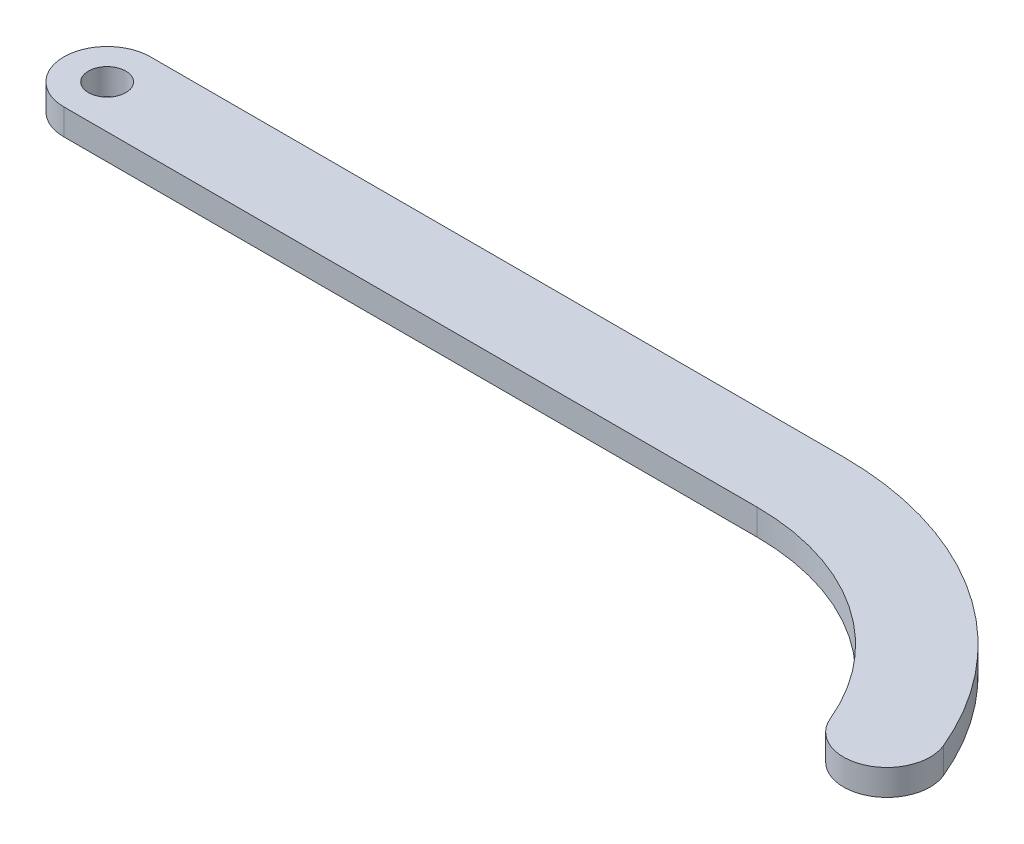
ISO-10303-21;
HEADER;
FILE_DESCRIPTION(('STEP AP214'),'2;1');
FILE_NAME('part.step','',(''),(''),'','','');
FILE_SCHEMA(('AUTOMOTIVE_DESIGN { 1 0 10303 214 1 1 1 1 }'));
ENDSEC;
DATA;
#1=APPLICATION_CONTEXT('core data for automotive mechanical design processes');
#2=APPLICATION_PROTOCOL_DEFINITION('international standard','automotive_design',2000,#1);
#3=PRODUCT_CONTEXT('',#1,'mechanical');
#4=PRODUCT('Part','Part','',(#3));
#5=PRODUCT_RELATED_PRODUCT_CATEGORY('part','',(#4));
#6=PRODUCT_DEFINITION_FORMATION('','',#4);
#7=PRODUCT_DEFINITION_CONTEXT('part definition',#1,'design');
#8=PRODUCT_DEFINITION('design','',#6,#7);
#9=PRODUCT_DEFINITION_SHAPE('','',#8);
#10=(LENGTH_UNIT() NAMED_UNIT(*) SI_UNIT(.MILLI.,.METRE.));
#11=(NAMED_UNIT(*) PLANE_ANGLE_UNIT() SI_UNIT($,.RADIAN.));
#12=(NAMED_UNIT(*) SI_UNIT($,.STERADIAN.) SOLID_ANGLE_UNIT());
#13=UNCERTAINTY_MEASURE_WITH_UNIT(LENGTH_MEASURE(1.E-05),#10,'distance_accuracy_value','');
#14=(GEOMETRIC_REPRESENTATION_CONTEXT(3) GLOBAL_UNCERTAINTY_ASSIGNED_CONTEXT((#13)) GLOBAL_UNIT_ASSIGNED_CONTEXT((#10,
#11,#12)) REPRESENTATION_CONTEXT('',''));
#15=CARTESIAN_POINT('',(0.,0.,0.));
#16=DIRECTION('',(0.,0.,1.));
#17=DIRECTION('',(1.,0.,0.));
#18=AXIS2_PLACEMENT_3D('',#15,#16,#17);
#19=CARTESIAN_POINT('',(0.,3.,0.));
#20=DIRECTION('',(0.,-1.,0.));
#21=DIRECTION('',(0.,0.,-1.));
#22=AXIS2_PLACEMENT_3D('',#19,#20,#21);
#23=CYLINDRICAL_SURFACE('',#22,5.);
#24=CARTESIAN_POINT('',(0.,0.,0.));
#25=DIRECTION('',(0.,1.,0.));
#26=DIRECTION('',(0.,0.,-1.));
#27=AXIS2_PLACEMENT_3D('',#24,#25,#26);
#28=CIRCLE('',#27,5.);
#29=CARTESIAN_POINT('',(0.,0.,-5.));
#30=VERTEX_POINT('',#29);
#31=CARTESIAN_POINT('',(0.,0.,5.));
#32=VERTEX_POINT('',#31);
#33=EDGE_CURVE('E117',#30,#32,#28,.T.);
#34=ORIENTED_EDGE('',*,*,#33,.T.);
#35=DIRECTION('',(0.,-1.,0.));
#36=VECTOR('',#35,1.);
#37=CARTESIAN_POINT('',(0.,3.,5.));
#38=LINE('',#37,#36);
#39=CARTESIAN_POINT('',(0.,3.,5.));
#40=VERTEX_POINT('',#39);
#41=EDGE_CURVE('E11',#40,#32,#38,.T.);
#42=ORIENTED_EDGE('',*,*,#41,.F.);
#43=CARTESIAN_POINT('',(0.,3.,0.));
#44=DIRECTION('',(0.,1.,0.));
#45=DIRECTION('',(0.,0.,-1.));
#46=AXIS2_PLACEMENT_3D('',#43,#44,#45);
#47=CIRCLE('',#46,5.);
#48=CARTESIAN_POINT('',(0.,3.,-5.));
#49=VERTEX_POINT('',#48);
#50=EDGE_CURVE('E128',#49,#40,#47,.T.);
#51=ORIENTED_EDGE('',*,*,#50,.F.);
#52=DIRECTION('',(0.,-1.,0.));
#53=VECTOR('',#52,1.);
#54=CARTESIAN_POINT('',(0.,3.,-5.));
#55=LINE('',#54,#53);
#56=EDGE_CURVE('E113',#49,#30,#55,.T.);
#57=ORIENTED_EDGE('',*,*,#56,.T.);
#58=EDGE_LOOP('',(#34,#42,#51,#57));
#59=FACE_BOUND('',#58,.T.);
#60=ADVANCED_FACE('F33',(#59),#23,.T.);
#61=CARTESIAN_POINT('',(80.0000000000004,3.,4.99999999999999));
#62=DIRECTION('',(0.,0.,-1.));
#63=DIRECTION('',(-1.,0.,0.));
#64=AXIS2_PLACEMENT_3D('',#61,#62,#63);
#65=PLANE('',#64);
#66=DIRECTION('',(1.,0.,0.));
#67=VECTOR('',#66,1.);
#68=CARTESIAN_POINT('',(80.0000000000004,0.,4.99999999999999));
#69=LINE('',#68,#67);
#70=CARTESIAN_POINT('',(80.0000000000004,0.,4.99999999999988));
#71=VERTEX_POINT('',#70);
#72=EDGE_CURVE('E120',#32,#71,#69,.T.);
#73=ORIENTED_EDGE('',*,*,#72,.T.);
#74=DIRECTION('',(0.,-1.,0.));
#75=VECTOR('',#74,1.);
#76=CARTESIAN_POINT('',(80.0000000000004,3.,4.99999999999988));
#77=LINE('',#76,#75);
#78=CARTESIAN_POINT('',(80.0000000000004,3.,4.99999999999988));
#79=VERTEX_POINT('',#78);
#80=EDGE_CURVE('E41',#79,#71,#77,.T.);
#81=ORIENTED_EDGE('',*,*,#80,.F.);
#82=DIRECTION('',(1.,0.,0.));
#83=VECTOR('',#82,1.);
#84=CARTESIAN_POINT('',(80.0000000000004,3.,4.99999999999999));
#85=LINE('',#84,#83);
#86=EDGE_CURVE('E86',#40,#79,#85,.T.);
#87=ORIENTED_EDGE('',*,*,#86,.F.);
#88=ORIENTED_EDGE('',*,*,#41,.T.);
#89=EDGE_LOOP('',(#73,#81,#87,#88));
#90=FACE_BOUND('',#89,.T.);
#91=ADVANCED_FACE('F153',(#90),#65,.F.);
#92=CARTESIAN_POINT('',(80.0000000000004,3.,32.4999999999991));
#93=DIRECTION('',(0.,-1.,0.));
#94=DIRECTION('',(0.,0.,-1.));
#95=AXIS2_PLACEMENT_3D('',#92,#93,#94);
#96=CYLINDRICAL_SURFACE('',#95,27.4999999999992);
#97=CARTESIAN_POINT('',(80.0000000000004,0.,32.4999999999991));
#98=DIRECTION('',(0.,-1.,0.));
#99=DIRECTION('',(0.,0.,1.));
#100=AXIS2_PLACEMENT_3D('',#97,#98,#99);
#101=CIRCLE('',#100,27.4999999999992);
#102=CARTESIAN_POINT('',(105.384615384615,0.,21.9230769230769));
#103=VERTEX_POINT('',#102);
#104=EDGE_CURVE('E123',#71,#103,#101,.T.);
#105=ORIENTED_EDGE('',*,*,#104,.T.);
#106=DIRECTION('',(0.,-1.,0.));
#107=VECTOR('',#106,1.);
#108=CARTESIAN_POINT('',(105.384615384615,3.,21.9230769230769));
#109=LINE('',#108,#107);
#110=CARTESIAN_POINT('',(105.384615384615,3.,21.9230769230769));
#111=VERTEX_POINT('',#110);
#112=EDGE_CURVE('E108',#111,#103,#109,.T.);
#113=ORIENTED_EDGE('',*,*,#112,.F.);
#114=CARTESIAN_POINT('',(80.0000000000004,3.,32.4999999999991));
#115=DIRECTION('',(0.,-1.,0.));
#116=DIRECTION('',(0.,0.,1.));
#117=AXIS2_PLACEMENT_3D('',#114,#115,#116);
#118=CIRCLE('',#117,27.4999999999992);
#119=EDGE_CURVE('E99',#79,#111,#118,.T.);
#120=ORIENTED_EDGE('',*,*,#119,.F.);
#121=ORIENTED_EDGE('',*,*,#80,.T.);
#122=EDGE_LOOP('',(#105,#113,#120,#121));
#123=FACE_BOUND('',#122,.T.);
#124=ADVANCED_FACE('F134',(#123),#96,.F.);
#125=CARTESIAN_POINT('',(110.,3.,20.));
#126=DIRECTION('',(0.,-1.,0.));
#127=DIRECTION('',(0.,0.,-1.));
#128=AXIS2_PLACEMENT_3D('',#125,#126,#127);
#129=CYLINDRICAL_SURFACE('',#128,5.);
#130=CARTESIAN_POINT('',(110.,0.,20.));
#131=DIRECTION('',(0.,1.,0.));
#132=DIRECTION('',(0.,0.,-1.));
#133=AXIS2_PLACEMENT_3D('',#130,#131,#132);
#134=CIRCLE('',#133,5.);
#135=CARTESIAN_POINT('',(114.615384615385,0.,18.0769230769231));
#136=VERTEX_POINT('',#135);
#137=EDGE_CURVE('E107',#103,#136,#134,.T.);
#138=ORIENTED_EDGE('',*,*,#137,.T.);
#139=DIRECTION('',(0.,-1.,0.));
#140=VECTOR('',#139,1.);
#141=CARTESIAN_POINT('',(114.615384615385,3.,18.0769230769231));
#142=LINE('',#141,#140);
#143=CARTESIAN_POINT('',(114.615384615385,3.,18.0769230769231));
#144=VERTEX_POINT('',#143);
#145=EDGE_CURVE('E104',#144,#136,#142,.T.);
#146=ORIENTED_EDGE('',*,*,#145,.F.);
#147=CARTESIAN_POINT('',(110.,3.,20.));
#148=DIRECTION('',(0.,1.,0.));
#149=DIRECTION('',(0.,0.,-1.));
#150=AXIS2_PLACEMENT_3D('',#147,#148,#149);
#151=CIRCLE('',#150,5.);
#152=EDGE_CURVE('E93',#111,#144,#151,.T.);
#153=ORIENTED_EDGE('',*,*,#152,.F.);
#154=ORIENTED_EDGE('',*,*,#112,.T.);
#155=EDGE_LOOP('',(#138,#146,#153,#154));
#156=FACE_BOUND('',#155,.T.);
#157=ADVANCED_FACE('F105',(#156),#129,.T.);
#158=CARTESIAN_POINT('',(80.,3.,32.5));
#159=DIRECTION('',(0.,-1.,0.));
#160=DIRECTION('',(0.,0.,-1.));
#161=AXIS2_PLACEMENT_3D('',#158,#159,#160);
#162=CYLINDRICAL_SURFACE('',#161,37.5);
#163=CARTESIAN_POINT('',(80.,0.,32.5));
#164=DIRECTION('',(0.,1.,0.));
#165=DIRECTION('',(0.,0.,-1.));
#166=AXIS2_PLACEMENT_3D('',#163,#164,#165);
#167=CIRCLE('',#166,37.5);
#168=CARTESIAN_POINT('',(80.,0.,-4.99999999999999));
#169=VERTEX_POINT('',#168);
#170=EDGE_CURVE('E72',#136,#169,#167,.T.);
#171=ORIENTED_EDGE('',*,*,#170,.T.);
#172=DIRECTION('',(0.,-1.,0.));
#173=VECTOR('',#172,1.);
#174=CARTESIAN_POINT('',(80.,3.,-4.99999999999999));
#175=LINE('',#174,#173);
#176=CARTESIAN_POINT('',(80.,3.,-4.99999999999999));
#177=VERTEX_POINT('',#176);
#178=EDGE_CURVE('E109',#177,#169,#175,.T.);
#179=ORIENTED_EDGE('',*,*,#178,.F.);
#180=CARTESIAN_POINT('',(80.,3.,32.5));
#181=DIRECTION('',(0.,1.,0.));
#182=DIRECTION('',(0.,0.,-1.));
#183=AXIS2_PLACEMENT_3D('',#180,#181,#182);
#184=CIRCLE('',#183,37.5);
#185=EDGE_CURVE('E97',#144,#177,#184,.T.);
#186=ORIENTED_EDGE('',*,*,#185,.F.);
#187=ORIENTED_EDGE('',*,*,#145,.T.);
#188=EDGE_LOOP('',(#171,#179,#186,#187));
#189=FACE_BOUND('',#188,.T.);
#190=ADVANCED_FACE('F111',(#189),#162,.T.);
#191=CARTESIAN_POINT('',(0.,3.,-5.));
#192=DIRECTION('',(0.,0.,1.));
#193=DIRECTION('',(1.,0.,0.));
#194=AXIS2_PLACEMENT_3D('',#191,#192,#193);
#195=PLANE('',#194);
#196=DIRECTION('',(-1.,0.,0.));
#197=VECTOR('',#196,1.);
#198=CARTESIAN_POINT('',(0.,0.,-5.));
#199=LINE('',#198,#197);
#200=EDGE_CURVE('E78',#169,#30,#199,.T.);
#201=ORIENTED_EDGE('',*,*,#200,.T.);
#202=ORIENTED_EDGE('',*,*,#56,.F.);
#203=DIRECTION('',(-1.,0.,0.));
#204=VECTOR('',#203,1.);
#205=CARTESIAN_POINT('',(0.,3.,-5.));
#206=LINE('',#205,#204);
#207=EDGE_CURVE('E49',#177,#49,#206,.T.);
#208=ORIENTED_EDGE('',*,*,#207,.F.);
#209=ORIENTED_EDGE('',*,*,#178,.T.);
#210=EDGE_LOOP('',(#201,#202,#208,#209));
#211=FACE_BOUND('',#210,.T.);
#212=ADVANCED_FACE('F141',(#211),#195,.F.);
#213=CARTESIAN_POINT('',(0.,3.,0.));
#214=DIRECTION('',(0.,-1.,0.));
#215=DIRECTION('',(0.,0.,-1.));
#216=AXIS2_PLACEMENT_3D('',#213,#214,#215);
#217=PLANE('',#216);
#218=CARTESIAN_POINT('',(0.,3.,0.));
#219=DIRECTION('',(0.,1.,0.));
#220=DIRECTION('',(0.,0.,1.));
#221=AXIS2_PLACEMENT_3D('',#218,#219,#220);
#222=CIRCLE('',#221,2.159);
#223=CARTESIAN_POINT('',(0.,3.,2.159));
#224=VERTEX_POINT('',#223);
#225=EDGE_CURVE('E121',#224,#224,#222,.T.);
#226=ORIENTED_EDGE('',*,*,#225,.F.);
#227=EDGE_LOOP('',(#226));
#228=FACE_BOUND('',#227,.T.);
#229=ORIENTED_EDGE('',*,*,#50,.T.);
#230=ORIENTED_EDGE('',*,*,#86,.T.);
#231=ORIENTED_EDGE('',*,*,#119,.T.);
#232=ORIENTED_EDGE('',*,*,#152,.T.);
#233=ORIENTED_EDGE('',*,*,#185,.T.);
#234=ORIENTED_EDGE('',*,*,#207,.T.);
#235=EDGE_LOOP('',(#229,#230,#231,#232,#233,#234));
#236=FACE_BOUND('',#235,.T.);
#237=ADVANCED_FACE('F95',(#228,#236),#217,.F.);
#238=CARTESIAN_POINT('',(0.,0.,0.));
#239=DIRECTION('',(0.,-1.,0.));
#240=DIRECTION('',(0.,0.,-1.));
#241=AXIS2_PLACEMENT_3D('',#238,#239,#240);
#242=PLANE('',#241);
#243=CARTESIAN_POINT('',(0.,0.,0.));
#244=DIRECTION('',(0.,-1.,0.));
#245=DIRECTION('',(0.,0.,-1.));
#246=AXIS2_PLACEMENT_3D('',#243,#244,#245);
#247=CIRCLE('',#246,2.159);
#248=CARTESIAN_POINT('',(0.,0.,-2.159));
#249=VERTEX_POINT('',#248);
#250=EDGE_CURVE('E206',#249,#249,#247,.F.);
#251=ORIENTED_EDGE('',*,*,#250,.T.);
#252=EDGE_LOOP('',(#251));
#253=FACE_BOUND('',#252,.T.);
#254=ORIENTED_EDGE('',*,*,#33,.F.);
#255=ORIENTED_EDGE('',*,*,#200,.F.);
#256=ORIENTED_EDGE('',*,*,#170,.F.);
#257=ORIENTED_EDGE('',*,*,#137,.F.);
#258=ORIENTED_EDGE('',*,*,#104,.F.);
#259=ORIENTED_EDGE('',*,*,#72,.F.);
#260=EDGE_LOOP('',(#254,#255,#256,#257,#258,#259));
#261=FACE_BOUND('',#260,.T.);
#262=ADVANCED_FACE('F137',(#253,#261),#242,.T.);
#263=CARTESIAN_POINT('',(0.,-0.00100000000000013,0.));
#264=DIRECTION('',(0.,1.,0.));
#265=DIRECTION('',(0.,0.,1.));
#266=AXIS2_PLACEMENT_3D('',#263,#264,#265);
#267=CYLINDRICAL_SURFACE('',#266,2.159);
#268=ORIENTED_EDGE('',*,*,#250,.F.);
#269=EDGE_LOOP('',(#268));
#270=FACE_BOUND('',#269,.T.);
#271=ORIENTED_EDGE('',*,*,#225,.T.);
#272=EDGE_LOOP('',(#271));
#273=FACE_BOUND('',#272,.T.);
#274=ADVANCED_FACE('F190',(#270,#273),#267,.F.);
#275=CLOSED_SHELL('',(#60,#91,#124,#157,#190,#212,#237,#262,#274));
#276=MANIFOLD_SOLID_BREP('B2',#275);
#277=ADVANCED_BREP_SHAPE_REPRESENTATION('',(#18,#276),#14);
#278=SHAPE_DEFINITION_REPRESENTATION(#9,#277);
ENDSEC;
END-ISO-10303-21;
